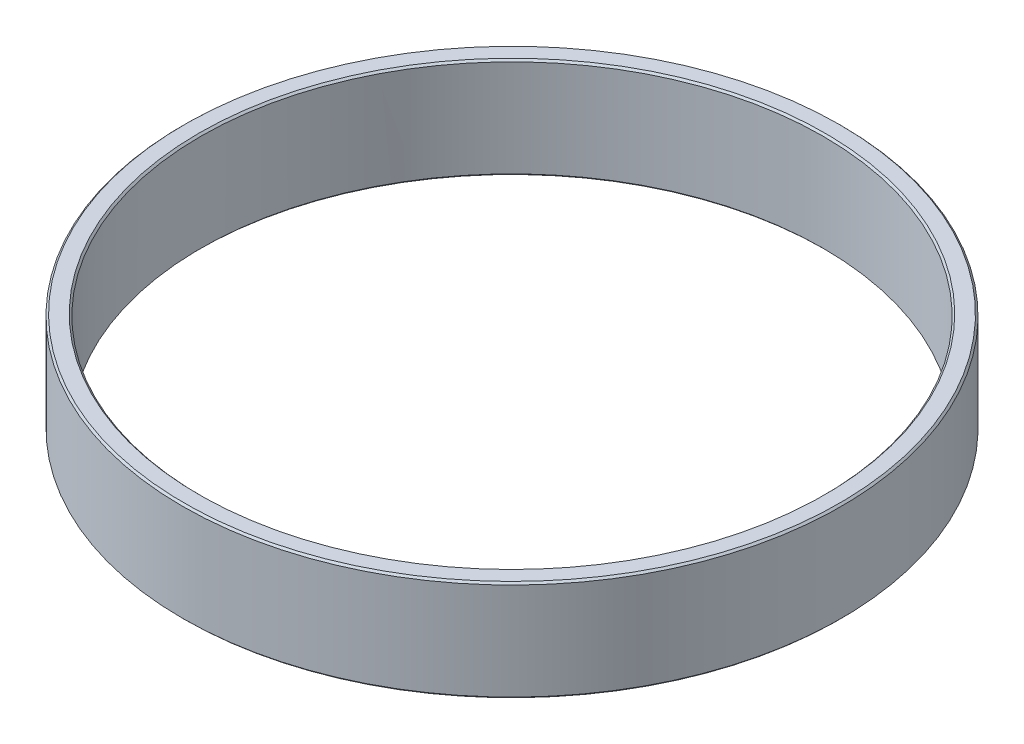
ISO-10303-21;
HEADER;
FILE_DESCRIPTION(('STEP AP214'),'2;1');
FILE_NAME('part.step','',(''),(''),'','','');
FILE_SCHEMA(('AUTOMOTIVE_DESIGN { 1 0 10303 214 1 1 1 1 }'));
ENDSEC;
DATA;
#1=APPLICATION_CONTEXT('core data for automotive mechanical design processes');
#2=APPLICATION_PROTOCOL_DEFINITION('international standard','automotive_design',2000,#1);
#3=PRODUCT_CONTEXT('',#1,'mechanical');
#4=PRODUCT('Part','Part','',(#3));
#5=PRODUCT_RELATED_PRODUCT_CATEGORY('part','',(#4));
#6=PRODUCT_DEFINITION_FORMATION('','',#4);
#7=PRODUCT_DEFINITION_CONTEXT('part definition',#1,'design');
#8=PRODUCT_DEFINITION('design','',#6,#7);
#9=PRODUCT_DEFINITION_SHAPE('','',#8);
#10=(LENGTH_UNIT() NAMED_UNIT(*) SI_UNIT(.MILLI.,.METRE.));
#11=(NAMED_UNIT(*) PLANE_ANGLE_UNIT() SI_UNIT($,.RADIAN.));
#12=(NAMED_UNIT(*) SI_UNIT($,.STERADIAN.) SOLID_ANGLE_UNIT());
#13=UNCERTAINTY_MEASURE_WITH_UNIT(LENGTH_MEASURE(1.E-05),#10,'distance_accuracy_value','');
#14=(GEOMETRIC_REPRESENTATION_CONTEXT(3) GLOBAL_UNCERTAINTY_ASSIGNED_CONTEXT((#13)) GLOBAL_UNIT_ASSIGNED_CONTEXT((#10,
#11,#12)) REPRESENTATION_CONTEXT('',''));
#15=CARTESIAN_POINT('',(0.,0.,0.));
#16=DIRECTION('',(0.,0.,1.));
#17=DIRECTION('',(1.,0.,0.));
#18=AXIS2_PLACEMENT_3D('',#15,#16,#17);
#19=CARTESIAN_POINT('',(0.,0.,0.));
#20=DIRECTION('',(0.,1.,0.));
#21=DIRECTION('',(0.,0.,1.));
#22=AXIS2_PLACEMENT_3D('',#19,#20,#21);
#23=CYLINDRICAL_SURFACE('',#22,17.);
#24=CARTESIAN_POINT('',(0.,0.0999999999988718,0.));
#25=DIRECTION('',(0.,-1.,0.));
#26=DIRECTION('',(0.,0.,-1.));
#27=AXIS2_PLACEMENT_3D('',#24,#25,#26);
#28=CIRCLE('',#27,16.9999999999989);
#29=CARTESIAN_POINT('',(0.,0.0999999999988727,-16.9999999999989));
#30=VERTEX_POINT('',#29);
#31=EDGE_CURVE('E32',#30,#30,#28,.T.);
#32=ORIENTED_EDGE('',*,*,#31,.T.);
#33=EDGE_LOOP('',(#32));
#34=FACE_BOUND('',#33,.T.);
#35=CARTESIAN_POINT('',(0.,5.40000000000099,0.));
#36=DIRECTION('',(0.,1.,0.));
#37=DIRECTION('',(0.,0.,-1.));
#38=AXIS2_PLACEMENT_3D('',#35,#36,#37);
#39=CIRCLE('',#38,16.999999999999);
#40=CARTESIAN_POINT('',(0.,5.40000000000099,-16.999999999999));
#41=VERTEX_POINT('',#40);
#42=EDGE_CURVE('E29',#41,#41,#39,.T.);
#43=ORIENTED_EDGE('',*,*,#42,.T.);
#44=EDGE_LOOP('',(#43));
#45=FACE_BOUND('',#44,.T.);
#46=ADVANCED_FACE('F14',(#34,#45),#23,.F.);
#47=CARTESIAN_POINT('',(0.,-1.1404722652375E-12,0.));
#48=DIRECTION('',(0.,-1.,0.));
#49=DIRECTION('',(0.,0.,-1.));
#50=AXIS2_PLACEMENT_3D('',#47,#48,#49);
#51=CONICAL_SURFACE('',#50,17.0999999999989,0.785398163397295);
#52=ORIENTED_EDGE('',*,*,#31,.F.);
#53=EDGE_LOOP('',(#52));
#54=FACE_BOUND('',#53,.T.);
#55=CARTESIAN_POINT('',(0.,-1.14145482345632E-12,0.));
#56=DIRECTION('',(0.,-1.,0.));
#57=DIRECTION('',(0.,0.,-1.));
#58=AXIS2_PLACEMENT_3D('',#55,#56,#57);
#59=CIRCLE('',#58,17.0999999999989);
#60=CARTESIAN_POINT('',(0.,-1.14145482345632E-12,-17.0999999999989));
#61=VERTEX_POINT('',#60);
#62=EDGE_CURVE('E17',#61,#61,#59,.T.);
#63=ORIENTED_EDGE('',*,*,#62,.T.);
#64=EDGE_LOOP('',(#63));
#65=FACE_BOUND('',#64,.T.);
#66=ADVANCED_FACE('F46',(#54,#65),#51,.F.);
#67=CARTESIAN_POINT('',(0.,5.50000000000101,0.));
#68=DIRECTION('',(0.,1.,0.));
#69=DIRECTION('',(-1.,0.,0.));
#70=AXIS2_PLACEMENT_3D('',#67,#68,#69);
#71=CONICAL_SURFACE('',#70,17.099999999999,0.785398163397297);
#72=ORIENTED_EDGE('',*,*,#42,.F.);
#73=EDGE_LOOP('',(#72));
#74=FACE_BOUND('',#73,.T.);
#75=CARTESIAN_POINT('',(0.,5.50000000000101,0.));
#76=DIRECTION('',(0.,1.,0.));
#77=DIRECTION('',(-1.,0.,0.));
#78=AXIS2_PLACEMENT_3D('',#75,#76,#77);
#79=CIRCLE('',#78,17.099999999999);
#80=CARTESIAN_POINT('',(-17.099999999999,5.50000000000101,0.));
#81=VERTEX_POINT('',#80);
#82=EDGE_CURVE('E39',#81,#81,#79,.F.);
#83=ORIENTED_EDGE('',*,*,#82,.F.);
#84=EDGE_LOOP('',(#83));
#85=FACE_BOUND('',#84,.T.);
#86=ADVANCED_FACE('F52',(#74,#85),#71,.F.);
#87=CARTESIAN_POINT('',(0.,0.,0.));
#88=DIRECTION('',(0.,1.,0.));
#89=DIRECTION('',(0.,0.,1.));
#90=AXIS2_PLACEMENT_3D('',#87,#88,#89);
#91=PLANE('',#90);
#92=ORIENTED_EDGE('',*,*,#62,.F.);
#93=EDGE_LOOP('',(#92));
#94=FACE_BOUND('',#93,.T.);
#95=CARTESIAN_POINT('',(0.,2.14758766325929E-12,0.));
#96=DIRECTION('',(0.,1.,0.));
#97=DIRECTION('',(0.,0.,1.));
#98=AXIS2_PLACEMENT_3D('',#95,#96,#97);
#99=CIRCLE('',#98,17.8999999999979);
#100=CARTESIAN_POINT('',(0.,2.14758766325929E-12,17.8999999999979));
#101=VERTEX_POINT('',#100);
#102=EDGE_CURVE('E37',#101,#101,#99,.T.);
#103=ORIENTED_EDGE('',*,*,#102,.F.);
#104=EDGE_LOOP('',(#103));
#105=FACE_BOUND('',#104,.T.);
#106=ADVANCED_FACE('F48',(#94,#105),#91,.F.);
#107=CARTESIAN_POINT('',(0.,5.5,0.));
#108=DIRECTION('',(0.,1.,0.));
#109=DIRECTION('',(0.,0.,1.));
#110=AXIS2_PLACEMENT_3D('',#107,#108,#109);
#111=PLANE('',#110);
#112=ORIENTED_EDGE('',*,*,#82,.T.);
#113=EDGE_LOOP('',(#112));
#114=FACE_BOUND('',#113,.T.);
#115=CARTESIAN_POINT('',(0.,5.49999999999801,0.));
#116=DIRECTION('',(0.,-1.,0.));
#117=DIRECTION('',(0.,0.,-1.));
#118=AXIS2_PLACEMENT_3D('',#115,#116,#117);
#119=CIRCLE('',#118,17.899999999998);
#120=CARTESIAN_POINT('',(0.,5.49999999999801,-17.899999999998));
#121=VERTEX_POINT('',#120);
#122=EDGE_CURVE('E26',#121,#121,#119,.T.);
#123=ORIENTED_EDGE('',*,*,#122,.F.);
#124=EDGE_LOOP('',(#123));
#125=FACE_BOUND('',#124,.T.);
#126=ADVANCED_FACE('F51',(#114,#125),#111,.T.);
#127=CARTESIAN_POINT('',(0.,0.100000000002314,0.));
#128=DIRECTION('',(0.,1.,0.));
#129=DIRECTION('',(0.,0.,1.));
#130=AXIS2_PLACEMENT_3D('',#127,#128,#129);
#131=CONICAL_SURFACE('',#130,17.999999999998,0.785398163397299);
#132=CARTESIAN_POINT('',(0.,0.1000000000003,0.));
#133=DIRECTION('',(0.,1.,0.));
#134=DIRECTION('',(0.,0.,1.));
#135=AXIS2_PLACEMENT_3D('',#132,#133,#134);
#136=CIRCLE('',#135,18.);
#137=CARTESIAN_POINT('',(0.,0.1000000000003,18.));
#138=VERTEX_POINT('',#137);
#139=EDGE_CURVE('E21',#138,#138,#136,.T.);
#140=ORIENTED_EDGE('',*,*,#139,.F.);
#141=EDGE_LOOP('',(#140));
#142=FACE_BOUND('',#141,.T.);
#143=ORIENTED_EDGE('',*,*,#102,.T.);
#144=EDGE_LOOP('',(#143));
#145=FACE_BOUND('',#144,.T.);
#146=ADVANCED_FACE('F56',(#142,#145),#131,.T.);
#147=CARTESIAN_POINT('',(0.,5.39999999999799,0.));
#148=DIRECTION('',(0.,-1.,0.));
#149=DIRECTION('',(0.,0.,-1.));
#150=AXIS2_PLACEMENT_3D('',#147,#148,#149);
#151=CONICAL_SURFACE('',#150,17.999999999998,0.785398163397297);
#152=CARTESIAN_POINT('',(0.,5.4,0.));
#153=DIRECTION('',(0.,1.,0.));
#154=DIRECTION('',(0.,0.,1.));
#155=AXIS2_PLACEMENT_3D('',#152,#153,#154);
#156=CIRCLE('',#155,18.);
#157=CARTESIAN_POINT('',(0.,5.4,18.));
#158=VERTEX_POINT('',#157);
#159=EDGE_CURVE('E10',#158,#158,#156,.F.);
#160=ORIENTED_EDGE('',*,*,#159,.F.);
#161=EDGE_LOOP('',(#160));
#162=FACE_BOUND('',#161,.T.);
#163=ORIENTED_EDGE('',*,*,#122,.T.);
#164=EDGE_LOOP('',(#163));
#165=FACE_BOUND('',#164,.T.);
#166=ADVANCED_FACE('F58',(#162,#165),#151,.T.);
#167=CARTESIAN_POINT('',(0.,0.,0.));
#168=DIRECTION('',(0.,1.,0.));
#169=DIRECTION('',(0.,0.,1.));
#170=AXIS2_PLACEMENT_3D('',#167,#168,#169);
#171=CYLINDRICAL_SURFACE('',#170,18.);
#172=ORIENTED_EDGE('',*,*,#139,.T.);
#173=EDGE_LOOP('',(#172));
#174=FACE_BOUND('',#173,.T.);
#175=ORIENTED_EDGE('',*,*,#159,.T.);
#176=EDGE_LOOP('',(#175));
#177=FACE_BOUND('',#176,.T.);
#178=ADVANCED_FACE('F66',(#174,#177),#171,.T.);
#179=CLOSED_SHELL('',(#46,#66,#86,#106,#126,#146,#166,#178));
#180=MANIFOLD_SOLID_BREP('B1',#179);
#181=ADVANCED_BREP_SHAPE_REPRESENTATION('',(#18,#180),#14);
#182=SHAPE_DEFINITION_REPRESENTATION(#9,#181);
ENDSEC;
END-ISO-10303-21;
